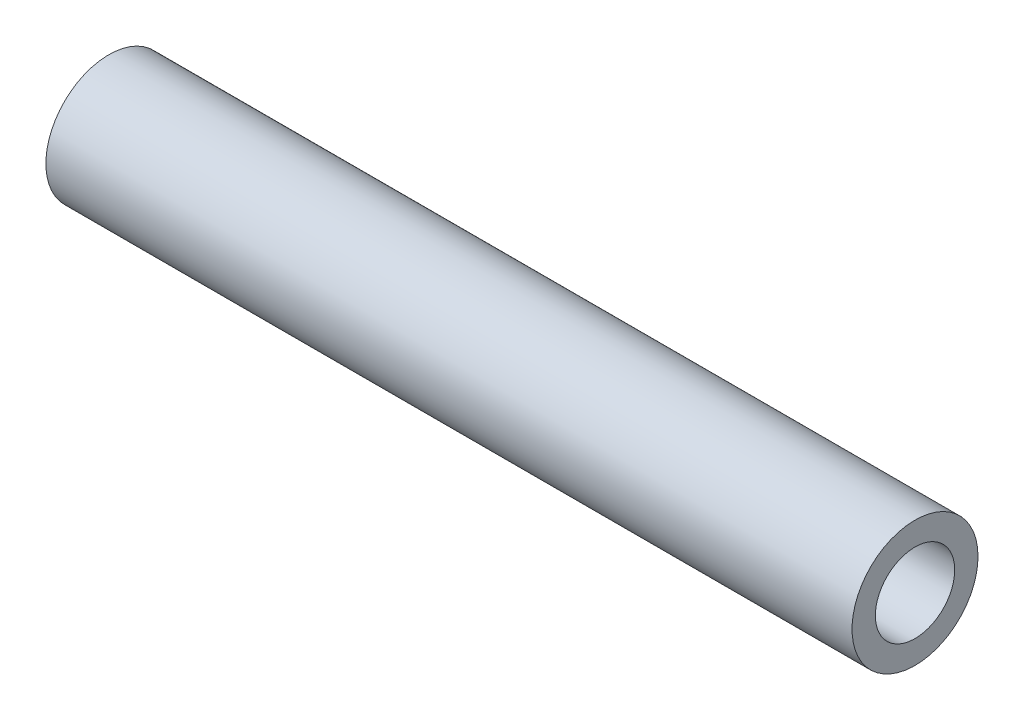
ISO-10303-21;
HEADER;
FILE_DESCRIPTION(('STEP AP214'),'2;1');
FILE_NAME('part.step','',(''),(''),'','','');
FILE_SCHEMA(('AUTOMOTIVE_DESIGN { 1 0 10303 214 1 1 1 1 }'));
ENDSEC;
DATA;
#1=APPLICATION_CONTEXT('core data for automotive mechanical design processes');
#2=APPLICATION_PROTOCOL_DEFINITION('international standard','automotive_design',2000,#1);
#3=PRODUCT_CONTEXT('',#1,'mechanical');
#4=PRODUCT('Part','Part','',(#3));
#5=PRODUCT_RELATED_PRODUCT_CATEGORY('part','',(#4));
#6=PRODUCT_DEFINITION_FORMATION('','',#4);
#7=PRODUCT_DEFINITION_CONTEXT('part definition',#1,'design');
#8=PRODUCT_DEFINITION('design','',#6,#7);
#9=PRODUCT_DEFINITION_SHAPE('','',#8);
#10=(LENGTH_UNIT() NAMED_UNIT(*) SI_UNIT(.MILLI.,.METRE.));
#11=(NAMED_UNIT(*) PLANE_ANGLE_UNIT() SI_UNIT($,.RADIAN.));
#12=(NAMED_UNIT(*) SI_UNIT($,.STERADIAN.) SOLID_ANGLE_UNIT());
#13=UNCERTAINTY_MEASURE_WITH_UNIT(LENGTH_MEASURE(1.E-05),#10,'distance_accuracy_value','');
#14=(GEOMETRIC_REPRESENTATION_CONTEXT(3) GLOBAL_UNCERTAINTY_ASSIGNED_CONTEXT((#13)) GLOBAL_UNIT_ASSIGNED_CONTEXT((#10,
#11,#12)) REPRESENTATION_CONTEXT('',''));
#15=CARTESIAN_POINT('',(0.,0.,0.));
#16=DIRECTION('',(0.,0.,1.));
#17=DIRECTION('',(1.,0.,0.));
#18=AXIS2_PLACEMENT_3D('',#15,#16,#17);
#19=CARTESIAN_POINT('',(25.4,0.,0.));
#20=DIRECTION('',(-1.,0.,0.));
#21=DIRECTION('',(0.,0.,1.));
#22=AXIS2_PLACEMENT_3D('',#19,#20,#21);
#23=CYLINDRICAL_SURFACE('',#22,3.96875);
#24=CARTESIAN_POINT('',(25.4,0.,0.));
#25=DIRECTION('',(1.,0.,0.));
#26=DIRECTION('',(0.,0.,-1.));
#27=AXIS2_PLACEMENT_3D('',#24,#25,#26);
#28=CIRCLE('',#27,3.96875);
#29=CARTESIAN_POINT('',(25.4,0.,-3.96875));
#30=VERTEX_POINT('',#29);
#31=EDGE_CURVE('E10',#30,#30,#28,.T.);
#32=ORIENTED_EDGE('',*,*,#31,.F.);
#33=EDGE_LOOP('',(#32));
#34=FACE_BOUND('',#33,.T.);
#35=CARTESIAN_POINT('',(-25.4,0.,0.));
#36=DIRECTION('',(1.,0.,0.));
#37=DIRECTION('',(0.,0.,-1.));
#38=AXIS2_PLACEMENT_3D('',#35,#36,#37);
#39=CIRCLE('',#38,3.96875);
#40=CARTESIAN_POINT('',(-25.4,0.,-3.96875));
#41=VERTEX_POINT('',#40);
#42=EDGE_CURVE('E34',#41,#41,#39,.T.);
#43=ORIENTED_EDGE('',*,*,#42,.T.);
#44=EDGE_LOOP('',(#43));
#45=FACE_BOUND('',#44,.T.);
#46=ADVANCED_FACE('F31',(#34,#45),#23,.T.);
#47=CARTESIAN_POINT('',(25.4,0.,0.));
#48=DIRECTION('',(1.,0.,0.));
#49=DIRECTION('',(0.,0.,-1.));
#50=AXIS2_PLACEMENT_3D('',#47,#48,#49);
#51=PLANE('',#50);
#52=CARTESIAN_POINT('',(25.4,0.,0.));
#53=DIRECTION('',(1.,0.,0.));
#54=DIRECTION('',(0.,0.,-1.));
#55=AXIS2_PLACEMENT_3D('',#52,#53,#54);
#56=CIRCLE('',#55,2.5);
#57=CARTESIAN_POINT('',(25.4,0.,-2.5));
#58=VERTEX_POINT('',#57);
#59=EDGE_CURVE('E43',#58,#58,#56,.T.);
#60=ORIENTED_EDGE('',*,*,#59,.F.);
#61=EDGE_LOOP('',(#60));
#62=FACE_BOUND('',#61,.T.);
#63=ORIENTED_EDGE('',*,*,#31,.T.);
#64=EDGE_LOOP('',(#63));
#65=FACE_BOUND('',#64,.T.);
#66=ADVANCED_FACE('F67',(#62,#65),#51,.T.);
#67=CARTESIAN_POINT('',(-25.4,0.,0.));
#68=DIRECTION('',(1.,0.,0.));
#69=DIRECTION('',(0.,0.,-1.));
#70=AXIS2_PLACEMENT_3D('',#67,#68,#69);
#71=PLANE('',#70);
#72=CARTESIAN_POINT('',(-25.4,0.,0.));
#73=DIRECTION('',(1.,0.,0.));
#74=DIRECTION('',(0.,0.,-1.));
#75=AXIS2_PLACEMENT_3D('',#72,#73,#74);
#76=CIRCLE('',#75,2.5);
#77=CARTESIAN_POINT('',(-25.4,0.,-2.5));
#78=VERTEX_POINT('',#77);
#79=EDGE_CURVE('E49',#78,#78,#76,.T.);
#80=ORIENTED_EDGE('',*,*,#79,.T.);
#81=EDGE_LOOP('',(#80));
#82=FACE_BOUND('',#81,.T.);
#83=ORIENTED_EDGE('',*,*,#42,.F.);
#84=EDGE_LOOP('',(#83));
#85=FACE_BOUND('',#84,.T.);
#86=ADVANCED_FACE('F72',(#82,#85),#71,.F.);
#87=CARTESIAN_POINT('',(12.7,0.,0.));
#88=DIRECTION('',(1.,0.,0.));
#89=DIRECTION('',(0.,0.,-1.));
#90=AXIS2_PLACEMENT_3D('',#87,#88,#89);
#91=CYLINDRICAL_SURFACE('',#90,2.5);
#92=CARTESIAN_POINT('',(12.7,0.,0.));
#93=DIRECTION('',(1.,0.,0.));
#94=DIRECTION('',(0.,0.,-1.));
#95=AXIS2_PLACEMENT_3D('',#92,#93,#94);
#96=CIRCLE('',#95,2.5);
#97=CARTESIAN_POINT('',(12.7,0.,-2.5));
#98=VERTEX_POINT('',#97);
#99=EDGE_CURVE('E41',#98,#98,#96,.T.);
#100=ORIENTED_EDGE('',*,*,#99,.F.);
#101=EDGE_LOOP('',(#100));
#102=FACE_BOUND('',#101,.T.);
#103=ORIENTED_EDGE('',*,*,#59,.T.);
#104=EDGE_LOOP('',(#103));
#105=FACE_BOUND('',#104,.T.);
#106=ADVANCED_FACE('F79',(#102,#105),#91,.F.);
#107=CARTESIAN_POINT('',(12.7,0.,0.));
#108=DIRECTION('',(1.,0.,0.));
#109=DIRECTION('',(0.,0.,-1.));
#110=AXIS2_PLACEMENT_3D('',#107,#108,#109);
#111=PLANE('',#110);
#112=ORIENTED_EDGE('',*,*,#99,.T.);
#113=EDGE_LOOP('',(#112));
#114=FACE_BOUND('',#113,.T.);
#115=ADVANCED_FACE('F64',(#114),#111,.T.);
#116=CARTESIAN_POINT('',(-12.7,0.,0.));
#117=DIRECTION('',(-1.,0.,0.));
#118=DIRECTION('',(0.,0.,1.));
#119=AXIS2_PLACEMENT_3D('',#116,#117,#118);
#120=CYLINDRICAL_SURFACE('',#119,2.5);
#121=CARTESIAN_POINT('',(-12.7,0.,0.));
#122=DIRECTION('',(1.,0.,0.));
#123=DIRECTION('',(0.,0.,-1.));
#124=AXIS2_PLACEMENT_3D('',#121,#122,#123);
#125=CIRCLE('',#124,2.5);
#126=CARTESIAN_POINT('',(-12.7,0.,-2.5));
#127=VERTEX_POINT('',#126);
#128=EDGE_CURVE('E46',#127,#127,#125,.T.);
#129=ORIENTED_EDGE('',*,*,#128,.T.);
#130=EDGE_LOOP('',(#129));
#131=FACE_BOUND('',#130,.T.);
#132=ORIENTED_EDGE('',*,*,#79,.F.);
#133=EDGE_LOOP('',(#132));
#134=FACE_BOUND('',#133,.T.);
#135=ADVANCED_FACE('F55',(#131,#134),#120,.F.);
#136=CARTESIAN_POINT('',(-12.7,0.,0.));
#137=DIRECTION('',(-1.,0.,0.));
#138=DIRECTION('',(0.,0.,-1.));
#139=AXIS2_PLACEMENT_3D('',#136,#137,#138);
#140=PLANE('',#139);
#141=ORIENTED_EDGE('',*,*,#128,.F.);
#142=EDGE_LOOP('',(#141));
#143=FACE_BOUND('',#142,.T.);
#144=ADVANCED_FACE('F58',(#143),#140,.T.);
#145=CLOSED_SHELL('',(#46,#66,#86,#106,#115,#135,#144));
#146=MANIFOLD_SOLID_BREP('B2',#145);
#147=ADVANCED_BREP_SHAPE_REPRESENTATION('',(#18,#146),#14);
#148=SHAPE_DEFINITION_REPRESENTATION(#9,#147);
ENDSEC;
END-ISO-10303-21;
